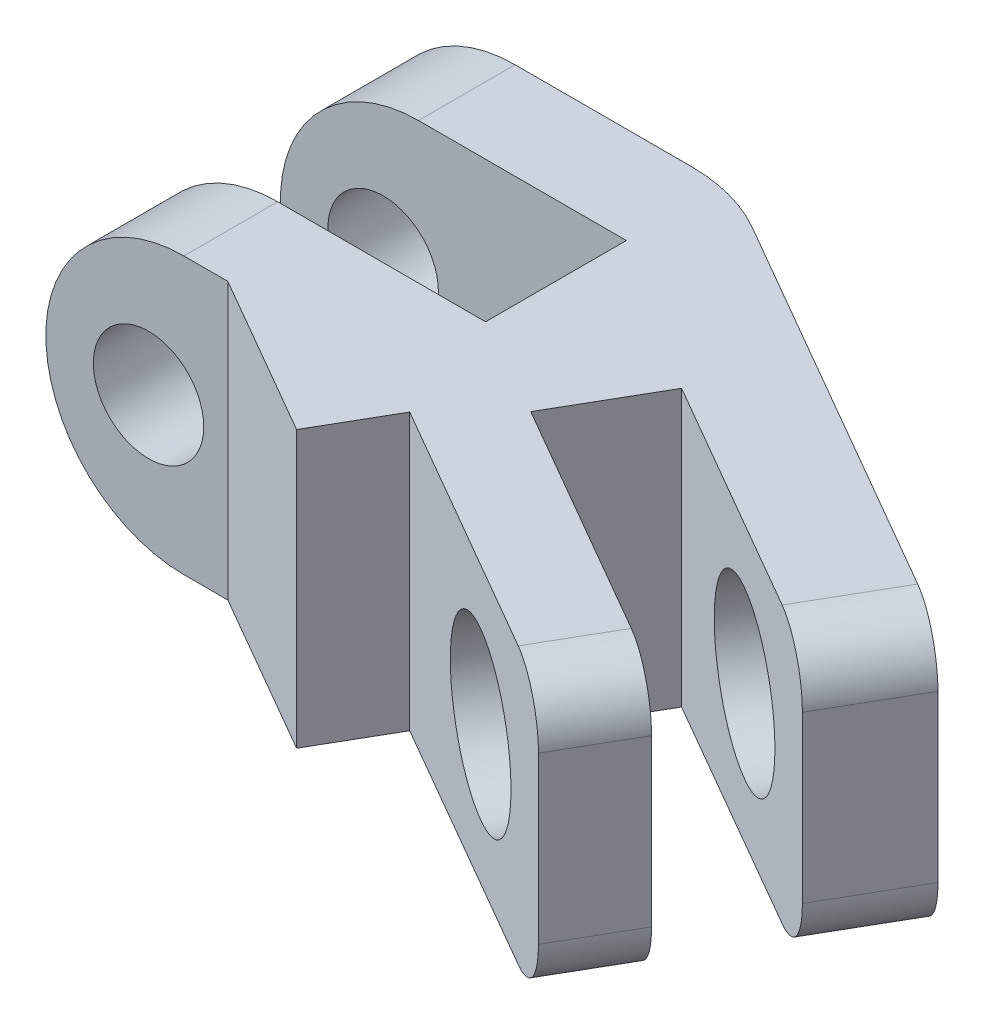
ISO-10303-21;
HEADER;
FILE_DESCRIPTION(('STEP AP214'),'2;1');
FILE_NAME('part.step','',(''),(''),'','','');
FILE_SCHEMA(('AUTOMOTIVE_DESIGN { 1 0 10303 214 1 1 1 1 }'));
ENDSEC;
DATA;
#1=APPLICATION_CONTEXT('core data for automotive mechanical design processes');
#2=APPLICATION_PROTOCOL_DEFINITION('international standard','automotive_design',2000,#1);
#3=PRODUCT_CONTEXT('',#1,'mechanical');
#4=PRODUCT('Part','Part','',(#3));
#5=PRODUCT_RELATED_PRODUCT_CATEGORY('part','',(#4));
#6=PRODUCT_DEFINITION_FORMATION('','',#4);
#7=PRODUCT_DEFINITION_CONTEXT('part definition',#1,'design');
#8=PRODUCT_DEFINITION('design','',#6,#7);
#9=PRODUCT_DEFINITION_SHAPE('','',#8);
#10=(LENGTH_UNIT() NAMED_UNIT(*) SI_UNIT(.MILLI.,.METRE.));
#11=(NAMED_UNIT(*) PLANE_ANGLE_UNIT() SI_UNIT($,.RADIAN.));
#12=(NAMED_UNIT(*) SI_UNIT($,.STERADIAN.) SOLID_ANGLE_UNIT());
#13=UNCERTAINTY_MEASURE_WITH_UNIT(LENGTH_MEASURE(1.E-05),#10,'distance_accuracy_value','');
#14=(GEOMETRIC_REPRESENTATION_CONTEXT(3) GLOBAL_UNCERTAINTY_ASSIGNED_CONTEXT((#13)) GLOBAL_UNIT_ASSIGNED_CONTEXT((#10,
#11,#12)) REPRESENTATION_CONTEXT('',''));
#15=CARTESIAN_POINT('',(0.,0.,0.));
#16=DIRECTION('',(0.,0.,1.));
#17=DIRECTION('',(1.,0.,0.));
#18=AXIS2_PLACEMENT_3D('',#15,#16,#17);
#19=CARTESIAN_POINT('',(0.,0.,6.));
#20=DIRECTION('',(0.,0.,-1.));
#21=DIRECTION('',(-1.,0.,0.));
#22=AXIS2_PLACEMENT_3D('',#19,#20,#21);
#23=CYLINDRICAL_SURFACE('',#22,2.5);
#24=CARTESIAN_POINT('',(0.,0.,1.75));
#25=DIRECTION('',(0.,0.,1.));
#26=DIRECTION('',(1.,0.,0.));
#27=AXIS2_PLACEMENT_3D('',#24,#25,#26);
#28=CIRCLE('',#27,2.5);
#29=CARTESIAN_POINT('',(0.,2.5,1.75));
#30=VERTEX_POINT('',#29);
#31=CARTESIAN_POINT('',(0.,-2.5,1.75));
#32=VERTEX_POINT('',#31);
#33=EDGE_CURVE('E218',#30,#32,#28,.T.);
#34=ORIENTED_EDGE('',*,*,#33,.F.);
#35=DIRECTION('',(0.,0.,-1.));
#36=VECTOR('',#35,1.);
#37=CARTESIAN_POINT('',(0.,2.5,12.4031242374328));
#38=LINE('',#37,#36);
#39=CARTESIAN_POINT('',(0.,2.5,0.));
#40=VERTEX_POINT('',#39);
#41=EDGE_CURVE('E304',#30,#40,#38,.T.);
#42=ORIENTED_EDGE('',*,*,#41,.T.);
#43=CARTESIAN_POINT('',(0.,0.,0.));
#44=DIRECTION('',(0.,0.,1.));
#45=DIRECTION('',(1.,0.,0.));
#46=AXIS2_PLACEMENT_3D('',#43,#44,#45);
#47=CIRCLE('',#46,2.5);
#48=CARTESIAN_POINT('',(0.,-2.5,0.));
#49=VERTEX_POINT('',#48);
#50=EDGE_CURVE('E308',#40,#49,#47,.T.);
#51=ORIENTED_EDGE('',*,*,#50,.T.);
#52=DIRECTION('',(0.,0.,-1.));
#53=VECTOR('',#52,1.);
#54=CARTESIAN_POINT('',(0.,-2.5,12.4031242374328));
#55=LINE('',#54,#53);
#56=EDGE_CURVE('E300',#32,#49,#55,.T.);
#57=ORIENTED_EDGE('',*,*,#56,.F.);
#58=EDGE_LOOP('',(#34,#42,#51,#57));
#59=FACE_BOUND('',#58,.T.);
#60=ADVANCED_FACE('F35',(#59),#23,.T.);
#61=CARTESIAN_POINT('',(-0.639695783803518,0.,0.));
#62=DIRECTION('',(0.,0.,1.));
#63=DIRECTION('',(1.,0.,0.));
#64=AXIS2_PLACEMENT_3D('',#61,#62,#63);
#65=CYLINDRICAL_SURFACE('',#64,1.);
#66=CARTESIAN_POINT('',(-0.639695783803518,0.,0.));
#67=DIRECTION('',(0.,0.,1.));
#68=DIRECTION('',(1.,0.,0.));
#69=AXIS2_PLACEMENT_3D('',#66,#67,#68);
#70=CIRCLE('',#69,1.);
#71=CARTESIAN_POINT('',(0.360304216196482,0.,0.));
#72=VERTEX_POINT('',#71);
#73=EDGE_CURVE('E245',#72,#72,#70,.T.);
#74=CARTESIAN_POINT('',(-0.639695783803518,0.,1.75));
#75=DIRECTION('',(0.,0.,1.));
#76=DIRECTION('',(1.,0.,0.));
#77=AXIS2_PLACEMENT_3D('',#74,#75,#76);
#78=CIRCLE('',#77,1.);
#79=CARTESIAN_POINT('',(0.360304216196482,0.,1.75));
#80=VERTEX_POINT('',#79);
#81=EDGE_CURVE('E244',#80,#80,#78,.F.);
#82=CARTESIAN_POINT('',(0.360304216196482,0.,0.));
#83=CARTESIAN_POINT('',(0.360304216196482,0.,0.0182291666666658));
#84=CARTESIAN_POINT('',(0.360304216196482,0.,0.0364583333333325));
#85=CARTESIAN_POINT('',(0.360304216196482,0.,0.0729166666666658));
#86=CARTESIAN_POINT('',(0.360304216196482,0.,0.0911458333333325));
#87=CARTESIAN_POINT('',(0.360304216196482,0.,0.127604166666666));
#88=CARTESIAN_POINT('',(0.360304216196482,0.,0.145833333333333));
#89=CARTESIAN_POINT('',(0.360304216196482,0.,0.182291666666666));
#90=CARTESIAN_POINT('',(0.360304216196482,0.,0.200520833333333));
#91=CARTESIAN_POINT('',(0.360304216196482,0.,0.236979166666666));
#92=CARTESIAN_POINT('',(0.360304216196482,0.,0.255208333333333));
#93=CARTESIAN_POINT('',(0.360304216196482,0.,0.291666666666666));
#94=CARTESIAN_POINT('',(0.360304216196482,0.,0.309895833333333));
#95=CARTESIAN_POINT('',(0.360304216196482,0.,0.346354166666666));
#96=CARTESIAN_POINT('',(0.360304216196482,0.,0.364583333333333));
#97=CARTESIAN_POINT('',(0.360304216196482,0.,0.401041666666666));
#98=CARTESIAN_POINT('',(0.360304216196482,0.,0.419270833333333));
#99=CARTESIAN_POINT('',(0.360304216196482,0.,0.455729166666666));
#100=CARTESIAN_POINT('',(0.360304216196482,0.,0.473958333333333));
#101=CARTESIAN_POINT('',(0.360304216196482,0.,0.510416666666666));
#102=CARTESIAN_POINT('',(0.360304216196482,0.,0.528645833333333));
#103=CARTESIAN_POINT('',(0.360304216196482,0.,0.565104166666666));
#104=CARTESIAN_POINT('',(0.360304216196482,0.,0.583333333333333));
#105=CARTESIAN_POINT('',(0.360304216196482,0.,0.619791666666666));
#106=CARTESIAN_POINT('',(0.360304216196482,0.,0.638020833333333));
#107=CARTESIAN_POINT('',(0.360304216196482,0.,0.674479166666666));
#108=CARTESIAN_POINT('',(0.360304216196482,0.,0.692708333333333));
#109=CARTESIAN_POINT('',(0.360304216196482,0.,0.729166666666666));
#110=CARTESIAN_POINT('',(0.360304216196482,0.,0.747395833333333));
#111=CARTESIAN_POINT('',(0.360304216196482,0.,0.783854166666666));
#112=CARTESIAN_POINT('',(0.360304216196482,0.,0.802083333333333));
#113=CARTESIAN_POINT('',(0.360304216196482,0.,0.838541666666666));
#114=CARTESIAN_POINT('',(0.360304216196482,0.,0.856770833333333));
#115=CARTESIAN_POINT('',(0.360304216196482,0.,0.893229166666666));
#116=CARTESIAN_POINT('',(0.360304216196482,0.,0.911458333333333));
#117=CARTESIAN_POINT('',(0.360304216196482,0.,0.947916666666666));
#118=CARTESIAN_POINT('',(0.360304216196482,0.,0.966145833333333));
#119=CARTESIAN_POINT('',(0.360304216196482,0.,1.00260416666667));
#120=CARTESIAN_POINT('',(0.360304216196482,0.,1.02083333333333));
#121=CARTESIAN_POINT('',(0.360304216196482,0.,1.05729166666667));
#122=CARTESIAN_POINT('',(0.360304216196482,0.,1.07552083333333));
#123=CARTESIAN_POINT('',(0.360304216196482,0.,1.11197916666667));
#124=CARTESIAN_POINT('',(0.360304216196482,0.,1.13020833333333));
#125=CARTESIAN_POINT('',(0.360304216196482,0.,1.16666666666667));
#126=CARTESIAN_POINT('',(0.360304216196482,0.,1.18489583333333));
#127=CARTESIAN_POINT('',(0.360304216196482,0.,1.22135416666667));
#128=CARTESIAN_POINT('',(0.360304216196482,0.,1.23958333333333));
#129=CARTESIAN_POINT('',(0.360304216196482,0.,1.27604166666667));
#130=CARTESIAN_POINT('',(0.360304216196482,0.,1.29427083333333));
#131=CARTESIAN_POINT('',(0.360304216196482,0.,1.33072916666667));
#132=CARTESIAN_POINT('',(0.360304216196482,0.,1.34895833333333));
#133=CARTESIAN_POINT('',(0.360304216196482,0.,1.38541666666667));
#134=CARTESIAN_POINT('',(0.360304216196482,0.,1.40364583333333));
#135=CARTESIAN_POINT('',(0.360304216196482,0.,1.44010416666667));
#136=CARTESIAN_POINT('',(0.360304216196482,0.,1.45833333333333));
#137=CARTESIAN_POINT('',(0.360304216196482,0.,1.49479166666667));
#138=CARTESIAN_POINT('',(0.360304216196482,0.,1.51302083333333));
#139=CARTESIAN_POINT('',(0.360304216196482,0.,1.54947916666667));
#140=CARTESIAN_POINT('',(0.360304216196482,0.,1.56770833333333));
#141=CARTESIAN_POINT('',(0.360304216196482,0.,1.60416666666667));
#142=CARTESIAN_POINT('',(0.360304216196482,0.,1.62239583333333));
#143=CARTESIAN_POINT('',(0.360304216196482,0.,1.65885416666667));
#144=CARTESIAN_POINT('',(0.360304216196482,0.,1.67708333333333));
#145=CARTESIAN_POINT('',(0.360304216196482,0.,1.71354166666667));
#146=CARTESIAN_POINT('',(0.360304216196482,0.,1.73177083333333));
#147=CARTESIAN_POINT('',(0.360304216196482,0.,1.75));
#148=B_SPLINE_CURVE_WITH_KNOTS('',3,(#82,#83,#84,#85,#86,#87,#88,#89,#90,#91,#92,#93,#94,#95,
#96,#97,#98,#99,#100,#101,#102,#103,#104,#105,#106,#107,#108,#109,#110,#111,#112,#113,#114,#115,
#116,#117,#118,#119,#120,#121,#122,#123,#124,#125,#126,#127,#128,#129,#130,#131,#132,#133,#134,
#135,#136,#137,#138,#139,#140,#141,#142,#143,#144,#145,#146,#147),.UNSPECIFIED.,.F.,.F.,(4,2,2,
2,2,2,2,2,2,2,2,2,2,2,2,2,2,2,2,2,2,2,2,2,2,2,2,2,2,2,2,2,4),(0.,0.0546875,0.109375,0.1640625,
0.21875,0.2734375,0.328125,0.3828125,0.4375,0.4921875,0.546875,0.6015625,0.65625,0.7109375,
0.765625,0.8203125,0.875,0.929687500000001,0.984375,1.0390625,1.09375,1.1484375,1.203125,
1.2578125,1.3125,1.3671875,1.421875,1.4765625,1.53125,1.5859375,1.640625,1.6953125,1.75),.UNSPECIFIED.);
#149=EDGE_CURVE('BSEAM453',#72,#80,#148,.T.);
#150=ORIENTED_EDGE('',*,*,#73,.F.);
#151=ORIENTED_EDGE('',*,*,#81,.F.);
#152=ORIENTED_EDGE('',*,*,#149,.T.);
#153=ORIENTED_EDGE('',*,*,#149,.F.);
#154=EDGE_LOOP('',(#150,#152,#151,#153));
#155=FACE_BOUND('',#154,.T.);
#156=ADVANCED_FACE('F453',(#155),#65,.F.);
#157=CARTESIAN_POINT('',(9.26121593216772,-2.5,10.8873066958947));
#158=DIRECTION('',(-0.866025403784438,0.,-0.500000000000001));
#159=DIRECTION('',(-0.500000000000001,0.,0.866025403784438));
#160=AXIS2_PLACEMENT_3D('',#157,#158,#159);
#161=PLANE('',#160);
#162=DIRECTION('',(0.,1.,0.));
#163=VECTOR('',#162,1.);
#164=CARTESIAN_POINT('',(12.6602540378444,-2.5,5.00000000000001));
#165=LINE('',#164,#163);
#166=CARTESIAN_POINT('',(12.6602540378444,-1.5,5.00000000000001));
#167=VERTEX_POINT('',#166);
#168=CARTESIAN_POINT('',(12.6602540378444,1.5,5.00000000000001));
#169=VERTEX_POINT('',#168);
#170=EDGE_CURVE('E283',#167,#169,#165,.T.);
#171=ORIENTED_EDGE('',*,*,#170,.T.);
#172=DIRECTION('',(0.500000000000001,0.,-0.866025403784438));
#173=VECTOR('',#172,1.);
#174=CARTESIAN_POINT('',(11.7612159321677,1.5,6.55717967697246));
#175=LINE('',#174,#173);
#176=CARTESIAN_POINT('',(11.7612159321677,1.5,6.55717967697246));
#177=VERTEX_POINT('',#176);
#178=EDGE_CURVE('E57',#169,#177,#175,.F.);
#179=ORIENTED_EDGE('',*,*,#178,.T.);
#180=DIRECTION('',(0.,1.,0.));
#181=VECTOR('',#180,1.);
#182=CARTESIAN_POINT('',(11.7612159321677,-2.5,6.55717967697246));
#183=LINE('',#182,#181);
#184=CARTESIAN_POINT('',(11.7612159321677,-1.5,6.55717967697246));
#185=VERTEX_POINT('',#184);
#186=EDGE_CURVE('E258',#185,#177,#183,.T.);
#187=ORIENTED_EDGE('',*,*,#186,.F.);
#188=DIRECTION('',(0.500000000000001,0.,-0.866025403784438));
#189=VECTOR('',#188,1.);
#190=CARTESIAN_POINT('',(12.6602540378444,-1.5,5.00000000000001));
#191=LINE('',#190,#189);
#192=EDGE_CURVE('E353',#185,#167,#191,.T.);
#193=ORIENTED_EDGE('',*,*,#192,.T.);
#194=EDGE_LOOP('',(#171,#179,#187,#193));
#195=FACE_BOUND('',#194,.T.);
#196=ADVANCED_FACE('F371',(#195),#161,.F.);
#197=CARTESIAN_POINT('',(0.,2.5,6.));
#198=VERTEX_POINT('',#197);
#199=CARTESIAN_POINT('',(0.,2.5,4.3));
#200=VERTEX_POINT('',#199);
#201=EDGE_CURVE('E305',#198,#200,#38,.T.);
#202=ORIENTED_EDGE('',*,*,#201,.T.);
#203=CARTESIAN_POINT('',(0.,0.,4.3));
#204=DIRECTION('',(0.,0.,1.));
#205=DIRECTION('',(1.,0.,0.));
#206=AXIS2_PLACEMENT_3D('',#203,#204,#205);
#207=CIRCLE('',#206,2.5);
#208=CARTESIAN_POINT('',(0.,-2.5,4.3));
#209=VERTEX_POINT('',#208);
#210=EDGE_CURVE('E228',#200,#209,#207,.T.);
#211=ORIENTED_EDGE('',*,*,#210,.T.);
#212=CARTESIAN_POINT('',(0.,-2.5,6.));
#213=VERTEX_POINT('',#212);
#214=EDGE_CURVE('E301',#213,#209,#55,.T.);
#215=ORIENTED_EDGE('',*,*,#214,.F.);
#216=CARTESIAN_POINT('',(0.,0.,6.));
#217=DIRECTION('',(0.,0.,1.));
#218=DIRECTION('',(1.,0.,0.));
#219=AXIS2_PLACEMENT_3D('',#216,#217,#218);
#220=CIRCLE('',#219,2.5);
#221=EDGE_CURVE('E309',#198,#213,#220,.T.);
#222=ORIENTED_EDGE('',*,*,#221,.F.);
#223=EDGE_LOOP('',(#202,#211,#215,#222));
#224=FACE_BOUND('',#223,.T.);
#225=ADVANCED_FACE('F411',(#224),#23,.T.);
#226=CARTESIAN_POINT('',(0.,0.,6.));
#227=DIRECTION('',(0.,0.,1.));
#228=DIRECTION('',(1.,0.,0.));
#229=AXIS2_PLACEMENT_3D('',#226,#227,#228);
#230=PLANE('',#229);
#231=CARTESIAN_POINT('',(-0.639695783803518,0.,6.));
#232=DIRECTION('',(0.,0.,1.));
#233=DIRECTION('',(1.,0.,0.));
#234=AXIS2_PLACEMENT_3D('',#231,#232,#233);
#235=CIRCLE('',#234,1.);
#236=CARTESIAN_POINT('',(0.360304216196482,0.,6.));
#237=VERTEX_POINT('',#236);
#238=EDGE_CURVE('E249',#237,#237,#235,.T.);
#239=ORIENTED_EDGE('',*,*,#238,.F.);
#240=EDGE_LOOP('',(#239));
#241=FACE_BOUND('',#240,.T.);
#242=DIRECTION('',(0.,-1.,0.));
#243=VECTOR('',#242,1.);
#244=CARTESIAN_POINT('',(0.796152422706628,0.,6.));
#245=LINE('',#244,#243);
#246=CARTESIAN_POINT('',(0.796152422706628,2.5,6.));
#247=VERTEX_POINT('',#246);
#248=CARTESIAN_POINT('',(0.79615242270663,-2.5,6.));
#249=VERTEX_POINT('',#248);
#250=EDGE_CURVE('E289',#247,#249,#245,.T.);
#251=ORIENTED_EDGE('',*,*,#250,.F.);
#252=DIRECTION('',(1.,0.,0.));
#253=VECTOR('',#252,1.);
#254=CARTESIAN_POINT('',(0.,2.5,6.));
#255=LINE('',#254,#253);
#256=EDGE_CURVE('E294',#198,#247,#255,.T.);
#257=ORIENTED_EDGE('',*,*,#256,.F.);
#258=ORIENTED_EDGE('',*,*,#221,.T.);
#259=DIRECTION('',(-1.,0.,0.));
#260=VECTOR('',#259,1.);
#261=CARTESIAN_POINT('',(0.,-2.5,6.));
#262=LINE('',#261,#260);
#263=EDGE_CURVE('E298',#249,#213,#262,.T.);
#264=ORIENTED_EDGE('',*,*,#263,.F.);
#265=EDGE_LOOP('',(#251,#257,#258,#264));
#266=FACE_BOUND('',#265,.T.);
#267=ADVANCED_FACE('F416',(#241,#266),#230,.T.);
#268=CARTESIAN_POINT('',(0.,0.,0.));
#269=DIRECTION('',(0.,0.,1.));
#270=DIRECTION('',(1.,0.,0.));
#271=AXIS2_PLACEMENT_3D('',#268,#269,#270);
#272=PLANE('',#271);
#273=ORIENTED_EDGE('',*,*,#73,.T.);
#274=EDGE_LOOP('',(#273));
#275=FACE_BOUND('',#274,.T.);
#276=DIRECTION('',(1.,0.,0.));
#277=VECTOR('',#276,1.);
#278=CARTESIAN_POINT('',(0.,2.5,0.));
#279=LINE('',#278,#277);
#280=CARTESIAN_POINT('',(3.19615242270663,2.5,0.));
#281=VERTEX_POINT('',#280);
#282=EDGE_CURVE('E291',#40,#281,#279,.T.);
#283=ORIENTED_EDGE('',*,*,#282,.T.);
#284=DIRECTION('',(0.,-1.,0.));
#285=VECTOR('',#284,1.);
#286=CARTESIAN_POINT('',(3.19615242270663,0.,0.));
#287=LINE('',#286,#285);
#288=CARTESIAN_POINT('',(3.19615242270663,-2.5,0.));
#289=VERTEX_POINT('',#288);
#290=EDGE_CURVE('E312',#281,#289,#287,.T.);
#291=ORIENTED_EDGE('',*,*,#290,.T.);
#292=DIRECTION('',(-1.,0.,0.));
#293=VECTOR('',#292,1.);
#294=CARTESIAN_POINT('',(0.,-2.5,0.));
#295=LINE('',#294,#293);
#296=EDGE_CURVE('E292',#289,#49,#295,.T.);
#297=ORIENTED_EDGE('',*,*,#296,.T.);
#298=ORIENTED_EDGE('',*,*,#50,.F.);
#299=EDGE_LOOP('',(#283,#291,#297,#298));
#300=FACE_BOUND('',#299,.T.);
#301=ADVANCED_FACE('F388',(#275,#300),#272,.F.);
#302=CARTESIAN_POINT('',(0.,2.5,12.4031242374328));
#303=DIRECTION('',(0.,1.,0.));
#304=DIRECTION('',(-1.,0.,0.));
#305=AXIS2_PLACEMENT_3D('',#302,#303,#304);
#306=PLANE('',#305);
#307=DIRECTION('',(-0.500000000000001,0.,0.866025403784438));
#308=VECTOR('',#307,1.);
#309=CARTESIAN_POINT('',(4.49439855055948,2.5,6.40313258987647));
#310=LINE('',#309,#308);
#311=CARTESIAN_POINT('',(4.49439855055948,2.5,6.40313258987647));
#312=VERTEX_POINT('',#311);
#313=CARTESIAN_POINT('',(3.74439855055948,2.5,7.70217069555312));
#314=VERTEX_POINT('',#313);
#315=EDGE_CURVE('E190',#312,#314,#310,.T.);
#316=ORIENTED_EDGE('',*,*,#315,.F.);
#317=DIRECTION('',(-0.866025403784438,0.,-0.500000000000001));
#318=VECTOR('',#317,1.);
#319=CARTESIAN_POINT('',(10.0112159321677,2.5,9.588268590218));
#320=LINE('',#319,#318);
#321=CARTESIAN_POINT('',(9.14519052838328,2.5,9.088268590218));
#322=VERTEX_POINT('',#321);
#323=EDGE_CURVE('E178',#322,#312,#320,.T.);
#324=ORIENTED_EDGE('',*,*,#323,.F.);
#325=DIRECTION('',(0.500000000000001,0.,-0.866025403784438));
#326=VECTOR('',#325,1.);
#327=CARTESIAN_POINT('',(9.89519052838328,2.5,7.78923048454134));
#328=LINE('',#327,#326);
#329=CARTESIAN_POINT('',(9.89519052838328,2.5,7.78923048454133));
#330=VERTEX_POINT('',#329);
#331=EDGE_CURVE('E347',#322,#330,#328,.T.);
#332=ORIENTED_EDGE('',*,*,#331,.T.);
#333=DIRECTION('',(-0.866025403784438,0.,-0.500000000000001));
#334=VECTOR('',#333,1.);
#335=CARTESIAN_POINT('',(10.7612159321677,2.5,8.28923048454133));
#336=LINE('',#335,#334);
#337=CARTESIAN_POINT('',(5.58442333430455,2.5,5.30040788462617));
#338=VERTEX_POINT('',#337);
#339=EDGE_CURVE('E271',#330,#338,#336,.T.);
#340=ORIENTED_EDGE('',*,*,#339,.T.);
#341=DIRECTION('',(0.500000000000001,0.,-0.866025403784438));
#342=VECTOR('',#341,1.);
#343=CARTESIAN_POINT('',(5.58442333430455,2.5,5.30040788462617));
#344=LINE('',#343,#342);
#345=CARTESIAN_POINT('',(6.58442333430456,2.5,3.56835707705729));
#346=VERTEX_POINT('',#345);
#347=EDGE_CURVE('E273',#338,#346,#344,.T.);
#348=ORIENTED_EDGE('',*,*,#347,.T.);
#349=DIRECTION('',(-0.866025403784438,0.,-0.500000000000001));
#350=VECTOR('',#349,1.);
#351=CARTESIAN_POINT('',(11.7612159321677,2.5,6.55717967697246));
#352=LINE('',#351,#350);
#353=CARTESIAN_POINT('',(10.8951905283833,2.5,6.05717967697246));
#354=VERTEX_POINT('',#353);
#355=EDGE_CURVE('E260',#354,#346,#352,.T.);
#356=ORIENTED_EDGE('',*,*,#355,.F.);
#357=DIRECTION('',(0.500000000000001,0.,-0.866025403784438));
#358=VECTOR('',#357,1.);
#359=CARTESIAN_POINT('',(11.7942286340599,2.5,4.50000000000001));
#360=LINE('',#359,#358);
#361=CARTESIAN_POINT('',(11.7942286340599,2.5,4.50000000000001));
#362=VERTEX_POINT('',#361);
#363=EDGE_CURVE('E344',#354,#362,#360,.T.);
#364=ORIENTED_EDGE('',*,*,#363,.T.);
#365=DIRECTION('',(-0.866025403784438,0.,-0.500000000000001));
#366=VECTOR('',#365,1.);
#367=CARTESIAN_POINT('',(12.6602540378444,2.5,5.00000000000001));
#368=LINE('',#367,#366);
#369=CARTESIAN_POINT('',(4.69615242270663,2.5,0.401923788646685));
#370=VERTEX_POINT('',#369);
#371=EDGE_CURVE('E278',#362,#370,#368,.T.);
#372=ORIENTED_EDGE('',*,*,#371,.T.);
#373=CARTESIAN_POINT('',(3.19615242270663,2.5,3.));
#374=DIRECTION('',(0.,1.,0.));
#375=DIRECTION('',(-1.,0.,0.));
#376=AXIS2_PLACEMENT_3D('',#373,#374,#375);
#377=CIRCLE('',#376,3.);
#378=EDGE_CURVE('E326',#370,#281,#377,.T.);
#379=ORIENTED_EDGE('',*,*,#378,.T.);
#380=ORIENTED_EDGE('',*,*,#282,.F.);
#381=ORIENTED_EDGE('',*,*,#41,.F.);
#382=DIRECTION('',(-1.,0.,0.));
#383=VECTOR('',#382,1.);
#384=CARTESIAN_POINT('',(3.76569860759446,2.5,1.75));
#385=LINE('',#384,#383);
#386=CARTESIAN_POINT('',(3.76569860759446,2.5,1.75));
#387=VERTEX_POINT('',#386);
#388=EDGE_CURVE('E226',#387,#30,#385,.T.);
#389=ORIENTED_EDGE('',*,*,#388,.F.);
#390=DIRECTION('',(0.,0.,-1.));
#391=VECTOR('',#390,1.);
#392=CARTESIAN_POINT('',(3.76569860759446,2.5,4.3));
#393=LINE('',#392,#391);
#394=CARTESIAN_POINT('',(3.76569860759446,2.5,4.3));
#395=VERTEX_POINT('',#394);
#396=EDGE_CURVE('E239',#395,#387,#393,.T.);
#397=ORIENTED_EDGE('',*,*,#396,.F.);
#398=DIRECTION('',(-1.,0.,0.));
#399=VECTOR('',#398,1.);
#400=CARTESIAN_POINT('',(3.76569860759446,2.5,4.3));
#401=LINE('',#400,#399);
#402=EDGE_CURVE('E236',#395,#200,#401,.T.);
#403=ORIENTED_EDGE('',*,*,#402,.T.);
#404=ORIENTED_EDGE('',*,*,#201,.F.);
#405=ORIENTED_EDGE('',*,*,#256,.T.);
#406=DIRECTION('',(-0.866025403784438,0.,-0.500000000000001));
#407=VECTOR('',#406,1.);
#408=CARTESIAN_POINT('',(9.26121593216772,2.5,10.8873066958947));
#409=LINE('',#408,#407);
#410=EDGE_CURVE('E198',#314,#247,#409,.T.);
#411=ORIENTED_EDGE('',*,*,#410,.F.);
#412=EDGE_LOOP('',(#316,#324,#332,#340,#348,#356,#364,#372,#379,#380,#381,#389,#397,#403,#404,
#405,#411));
#413=FACE_BOUND('',#412,.T.);
#414=ADVANCED_FACE('F196',(#413),#306,.T.);
#415=CARTESIAN_POINT('',(0.,-2.5,12.4031242374328));
#416=DIRECTION('',(0.,-1.,0.));
#417=DIRECTION('',(1.,0.,0.));
#418=AXIS2_PLACEMENT_3D('',#415,#416,#417);
#419=PLANE('',#418);
#420=DIRECTION('',(0.500000000000001,0.,-0.866025403784438));
#421=VECTOR('',#420,1.);
#422=CARTESIAN_POINT('',(0.772726318280463,-2.5,12.849257985302));
#423=LINE('',#422,#421);
#424=CARTESIAN_POINT('',(3.74439855055948,-2.5,7.70217069555312));
#425=VERTEX_POINT('',#424);
#426=CARTESIAN_POINT('',(4.49439855055948,-2.5,6.40313258987647));
#427=VERTEX_POINT('',#426);
#428=EDGE_CURVE('E193',#425,#427,#423,.T.);
#429=ORIENTED_EDGE('',*,*,#428,.F.);
#430=DIRECTION('',(0.866025403784438,0.,0.500000000000001));
#431=VECTOR('',#430,1.);
#432=CARTESIAN_POINT('',(0.600961894323334,-2.5,5.88730669589464));
#433=LINE('',#432,#431);
#434=EDGE_CURVE('E286',#249,#425,#433,.T.);
#435=ORIENTED_EDGE('',*,*,#434,.F.);
#436=ORIENTED_EDGE('',*,*,#263,.T.);
#437=ORIENTED_EDGE('',*,*,#214,.T.);
#438=DIRECTION('',(1.,0.,0.));
#439=VECTOR('',#438,1.);
#440=CARTESIAN_POINT('',(0.,-2.5,4.3));
#441=LINE('',#440,#439);
#442=CARTESIAN_POINT('',(3.76569860759446,-2.5,4.3));
#443=VERTEX_POINT('',#442);
#444=EDGE_CURVE('E231',#209,#443,#441,.T.);
#445=ORIENTED_EDGE('',*,*,#444,.T.);
#446=DIRECTION('',(0.,0.,-1.));
#447=VECTOR('',#446,1.);
#448=CARTESIAN_POINT('',(3.76569860759446,-2.5,4.3));
#449=LINE('',#448,#447);
#450=CARTESIAN_POINT('',(3.76569860759446,-2.5,1.75));
#451=VERTEX_POINT('',#450);
#452=EDGE_CURVE('E241',#443,#451,#449,.T.);
#453=ORIENTED_EDGE('',*,*,#452,.T.);
#454=DIRECTION('',(1.,0.,0.));
#455=VECTOR('',#454,1.);
#456=CARTESIAN_POINT('',(0.,-2.5,1.75));
#457=LINE('',#456,#455);
#458=EDGE_CURVE('E220',#32,#451,#457,.T.);
#459=ORIENTED_EDGE('',*,*,#458,.F.);
#460=ORIENTED_EDGE('',*,*,#56,.T.);
#461=ORIENTED_EDGE('',*,*,#296,.F.);
#462=CARTESIAN_POINT('',(3.19615242270663,-2.5,3.));
#463=DIRECTION('',(0.,-1.,0.));
#464=DIRECTION('',(1.,0.,0.));
#465=AXIS2_PLACEMENT_3D('',#462,#463,#464);
#466=CIRCLE('',#465,3.);
#467=CARTESIAN_POINT('',(4.69615242270663,-2.5,0.401923788646685));
#468=VERTEX_POINT('',#467);
#469=EDGE_CURVE('E321',#289,#468,#466,.T.);
#470=ORIENTED_EDGE('',*,*,#469,.T.);
#471=DIRECTION('',(0.866025403784438,0.,0.500000000000001));
#472=VECTOR('',#471,1.);
#473=CARTESIAN_POINT('',(4.,-2.5,0.));
#474=LINE('',#473,#472);
#475=CARTESIAN_POINT('',(11.7942286340599,-2.5,4.50000000000001));
#476=VERTEX_POINT('',#475);
#477=EDGE_CURVE('E280',#468,#476,#474,.T.);
#478=ORIENTED_EDGE('',*,*,#477,.T.);
#479=DIRECTION('',(0.500000000000001,0.,-0.866025403784438));
#480=VECTOR('',#479,1.);
#481=CARTESIAN_POINT('',(10.8951905283833,-2.5,6.05717967697246));
#482=LINE('',#481,#480);
#483=CARTESIAN_POINT('',(10.8951905283833,-2.5,6.05717967697246));
#484=VERTEX_POINT('',#483);
#485=EDGE_CURVE('E339',#476,#484,#482,.F.);
#486=ORIENTED_EDGE('',*,*,#485,.T.);
#487=DIRECTION('',(0.866025403784438,0.,0.500000000000001));
#488=VECTOR('',#487,1.);
#489=CARTESIAN_POINT('',(6.58442333430456,-2.5,3.56835707705729));
#490=LINE('',#489,#488);
#491=CARTESIAN_POINT('',(6.58442333430456,-2.5,3.56835707705729));
#492=VERTEX_POINT('',#491);
#493=EDGE_CURVE('E255',#492,#484,#490,.T.);
#494=ORIENTED_EDGE('',*,*,#493,.F.);
#495=DIRECTION('',(0.500000000000001,0.,-0.866025403784438));
#496=VECTOR('',#495,1.);
#497=CARTESIAN_POINT('',(5.58442333430455,-2.5,5.30040788462617));
#498=LINE('',#497,#496);
#499=CARTESIAN_POINT('',(5.58442333430455,-2.5,5.30040788462617));
#500=VERTEX_POINT('',#499);
#501=EDGE_CURVE('E276',#500,#492,#498,.T.);
#502=ORIENTED_EDGE('',*,*,#501,.F.);
#503=DIRECTION('',(0.866025403784438,0.,0.500000000000001));
#504=VECTOR('',#503,1.);
#505=CARTESIAN_POINT('',(5.58442333430455,-2.5,5.30040788462617));
#506=LINE('',#505,#504);
#507=CARTESIAN_POINT('',(9.89519052838328,-2.5,7.78923048454134));
#508=VERTEX_POINT('',#507);
#509=EDGE_CURVE('E265',#500,#508,#506,.T.);
#510=ORIENTED_EDGE('',*,*,#509,.T.);
#511=DIRECTION('',(0.500000000000001,0.,-0.866025403784438));
#512=VECTOR('',#511,1.);
#513=CARTESIAN_POINT('',(8.39519052838328,-2.5,10.3873066958946));
#514=LINE('',#513,#512);
#515=CARTESIAN_POINT('',(9.14519052838328,-2.5,9.088268590218));
#516=VERTEX_POINT('',#515);
#517=EDGE_CURVE('E341',#508,#516,#514,.F.);
#518=ORIENTED_EDGE('',*,*,#517,.T.);
#519=DIRECTION('',(0.866025403784438,0.,0.500000000000001));
#520=VECTOR('',#519,1.);
#521=CARTESIAN_POINT('',(3.72167223227902,-2.5,5.95699884200733));
#522=LINE('',#521,#520);
#523=EDGE_CURVE('E201',#427,#516,#522,.T.);
#524=ORIENTED_EDGE('',*,*,#523,.F.);
#525=EDGE_LOOP('',(#429,#435,#436,#437,#445,#453,#459,#460,#461,#470,#478,#486,#494,#502,#510,
#518,#524));
#526=FACE_BOUND('',#525,.T.);
#527=ADVANCED_FACE('F379',(#526),#419,.T.);
#528=DIRECTION('',(0.500000000000001,0.,-0.866025403784438));
#529=VECTOR('',#528,1.);
#530=CARTESIAN_POINT('',(9.26121593216772,1.5,10.8873066958947));
#531=LINE('',#530,#529);
#532=CARTESIAN_POINT('',(10.7612159321677,1.5,8.28923048454133));
#533=VERTEX_POINT('',#532);
#534=CARTESIAN_POINT('',(10.0112159321677,1.5,9.588268590218));
#535=VERTEX_POINT('',#534);
#536=EDGE_CURVE('E328',#533,#535,#531,.F.);
#537=ORIENTED_EDGE('',*,*,#536,.T.);
#538=DIRECTION('',(0.,1.,0.));
#539=VECTOR('',#538,1.);
#540=CARTESIAN_POINT('',(10.0112159321677,2.5,9.588268590218));
#541=LINE('',#540,#539);
#542=CARTESIAN_POINT('',(10.0112159321677,-1.5,9.588268590218));
#543=VERTEX_POINT('',#542);
#544=EDGE_CURVE('E49',#543,#535,#541,.T.);
#545=ORIENTED_EDGE('',*,*,#544,.F.);
#546=DIRECTION('',(0.500000000000001,0.,-0.866025403784438));
#547=VECTOR('',#546,1.);
#548=CARTESIAN_POINT('',(10.7612159321677,-1.5,8.28923048454133));
#549=LINE('',#548,#547);
#550=CARTESIAN_POINT('',(10.7612159321677,-1.5,8.28923048454133));
#551=VERTEX_POINT('',#550);
#552=EDGE_CURVE('E333',#543,#551,#549,.T.);
#553=ORIENTED_EDGE('',*,*,#552,.T.);
#554=DIRECTION('',(0.,1.,0.));
#555=VECTOR('',#554,1.);
#556=CARTESIAN_POINT('',(10.7612159321677,-2.5,8.28923048454133));
#557=LINE('',#556,#555);
#558=EDGE_CURVE('E268',#551,#533,#557,.T.);
#559=ORIENTED_EDGE('',*,*,#558,.T.);
#560=EDGE_LOOP('',(#537,#545,#553,#559));
#561=FACE_BOUND('',#560,.T.);
#562=ADVANCED_FACE('F428',(#561),#161,.F.);
#563=CARTESIAN_POINT('',(-2.39903810567666,0.,4.15525588832576));
#564=DIRECTION('',(-0.500000000000001,0.,0.866025403784438));
#565=DIRECTION('',(0.866025403784438,0.,0.500000000000001));
#566=AXIS2_PLACEMENT_3D('',#563,#564,#565);
#567=PLANE('',#566);
#568=DIRECTION('',(0.,-1.,0.));
#569=VECTOR('',#568,1.);
#570=CARTESIAN_POINT('',(3.74439855055948,2.5,7.70217069555312));
#571=LINE('',#570,#569);
#572=EDGE_CURVE('E204',#314,#425,#571,.T.);
#573=ORIENTED_EDGE('',*,*,#572,.F.);
#574=ORIENTED_EDGE('',*,*,#410,.T.);
#575=ORIENTED_EDGE('',*,*,#250,.T.);
#576=ORIENTED_EDGE('',*,*,#434,.T.);
#577=EDGE_LOOP('',(#573,#574,#575,#576));
#578=FACE_BOUND('',#577,.T.);
#579=ADVANCED_FACE('F419',(#578),#567,.T.);
#580=CARTESIAN_POINT('',(1.,0.,-1.73205080756888));
#581=DIRECTION('',(-0.500000000000001,0.,0.866025403784438));
#582=DIRECTION('',(0.866025403784438,0.,0.500000000000001));
#583=AXIS2_PLACEMENT_3D('',#580,#581,#582);
#584=PLANE('',#583);
#585=CARTESIAN_POINT('',(10.1847912420043,0.,3.57079088845282));
#586=DIRECTION('',(-0.500000000000001,0.,0.866025403784438));
#587=DIRECTION('',(0.866025403784438,0.,0.500000000000001));
#588=AXIS2_PLACEMENT_3D('',#585,#586,#587);
#589=CIRCLE('',#588,1.5);
#590=CARTESIAN_POINT('',(11.4838293476809,0.,4.32079088845282));
#591=VERTEX_POINT('',#590);
#592=EDGE_CURVE('E215',#591,#591,#589,.T.);
#593=ORIENTED_EDGE('',*,*,#592,.T.);
#594=EDGE_LOOP('',(#593));
#595=FACE_BOUND('',#594,.T.);
#596=ORIENTED_EDGE('',*,*,#371,.F.);
#597=CARTESIAN_POINT('',(11.7942286340599,1.5,4.50000000000001));
#598=DIRECTION('',(-0.500000000000001,0.,0.866025403784438));
#599=DIRECTION('',(0.866025403784438,0.,0.500000000000001));
#600=AXIS2_PLACEMENT_3D('',#597,#598,#599);
#601=CIRCLE('',#600,1.);
#602=EDGE_CURVE('E351',#362,#169,#601,.F.);
#603=ORIENTED_EDGE('',*,*,#602,.T.);
#604=ORIENTED_EDGE('',*,*,#170,.F.);
#605=CARTESIAN_POINT('',(11.7942286340599,-1.5,4.50000000000001));
#606=DIRECTION('',(-0.500000000000001,0.,0.866025403784438));
#607=DIRECTION('',(0.866025403784438,0.,0.500000000000001));
#608=AXIS2_PLACEMENT_3D('',#605,#606,#607);
#609=CIRCLE('',#608,1.);
#610=EDGE_CURVE('E349',#167,#476,#609,.F.);
#611=ORIENTED_EDGE('',*,*,#610,.T.);
#612=ORIENTED_EDGE('',*,*,#477,.F.);
#613=DIRECTION('',(0.,-1.,0.));
#614=VECTOR('',#613,1.);
#615=CARTESIAN_POINT('',(4.69615242270663,0.,0.401923788646686));
#616=LINE('',#615,#614);
#617=EDGE_CURVE('E323',#468,#370,#616,.F.);
#618=ORIENTED_EDGE('',*,*,#617,.T.);
#619=EDGE_LOOP('',(#596,#603,#604,#611,#612,#618));
#620=FACE_BOUND('',#619,.T.);
#621=ADVANCED_FACE('F370',(#595,#620),#584,.F.);
#622=CARTESIAN_POINT('',(5.58442333430455,2.5,5.30040788462617));
#623=DIRECTION('',(0.866025403784438,0.,0.500000000000001));
#624=DIRECTION('',(0.500000000000001,0.,-0.866025403784438));
#625=AXIS2_PLACEMENT_3D('',#622,#623,#624);
#626=PLANE('',#625);
#627=ORIENTED_EDGE('',*,*,#347,.F.);
#628=DIRECTION('',(0.,-1.,0.));
#629=VECTOR('',#628,1.);
#630=CARTESIAN_POINT('',(5.58442333430455,2.5,5.30040788462617));
#631=LINE('',#630,#629);
#632=EDGE_CURVE('E262',#338,#500,#631,.T.);
#633=ORIENTED_EDGE('',*,*,#632,.T.);
#634=ORIENTED_EDGE('',*,*,#501,.T.);
#635=DIRECTION('',(0.,-1.,0.));
#636=VECTOR('',#635,1.);
#637=CARTESIAN_POINT('',(6.58442333430456,2.5,3.56835707705729));
#638=LINE('',#637,#636);
#639=EDGE_CURVE('E248',#346,#492,#638,.T.);
#640=ORIENTED_EDGE('',*,*,#639,.F.);
#641=EDGE_LOOP('',(#627,#633,#634,#640));
#642=FACE_BOUND('',#641,.T.);
#643=ADVANCED_FACE('F438',(#642),#626,.T.);
#644=CARTESIAN_POINT('',(-0.89903810567666,0.,1.55717967697245));
#645=DIRECTION('',(-0.500000000000001,0.,0.866025403784438));
#646=DIRECTION('',(0.866025403784438,0.,0.500000000000001));
#647=AXIS2_PLACEMENT_3D('',#644,#645,#646);
#648=PLANE('',#647);
#649=CARTESIAN_POINT('',(8.28575313632761,0.,6.86002137299414));
#650=DIRECTION('',(-0.500000000000001,0.,0.866025403784438));
#651=DIRECTION('',(0.866025403784438,0.,0.500000000000001));
#652=AXIS2_PLACEMENT_3D('',#649,#650,#651);
#653=CIRCLE('',#652,1.5);
#654=CARTESIAN_POINT('',(9.58479124200427,0.,7.61002137299414));
#655=VERTEX_POINT('',#654);
#656=EDGE_CURVE('E212',#655,#655,#653,.T.);
#657=ORIENTED_EDGE('',*,*,#656,.T.);
#658=EDGE_LOOP('',(#657));
#659=FACE_BOUND('',#658,.T.);
#660=ORIENTED_EDGE('',*,*,#558,.F.);
#661=CARTESIAN_POINT('',(9.89519052838328,-1.5,7.78923048454133));
#662=DIRECTION('',(-0.500000000000001,0.,0.866025403784438));
#663=DIRECTION('',(0.866025403784438,0.,0.500000000000001));
#664=AXIS2_PLACEMENT_3D('',#661,#662,#663);
#665=CIRCLE('',#664,1.);
#666=EDGE_CURVE('E337',#551,#508,#665,.F.);
#667=ORIENTED_EDGE('',*,*,#666,.T.);
#668=ORIENTED_EDGE('',*,*,#509,.F.);
#669=ORIENTED_EDGE('',*,*,#632,.F.);
#670=ORIENTED_EDGE('',*,*,#339,.F.);
#671=CARTESIAN_POINT('',(9.89519052838328,1.5,7.78923048454134));
#672=DIRECTION('',(-0.500000000000001,0.,0.866025403784438));
#673=DIRECTION('',(0.866025403784438,0.,0.500000000000001));
#674=AXIS2_PLACEMENT_3D('',#671,#672,#673);
#675=CIRCLE('',#674,1.);
#676=EDGE_CURVE('E335',#330,#533,#675,.F.);
#677=ORIENTED_EDGE('',*,*,#676,.T.);
#678=EDGE_LOOP('',(#660,#667,#668,#669,#670,#677));
#679=FACE_BOUND('',#678,.T.);
#680=ADVANCED_FACE('F440',(#659,#679),#648,.F.);
#681=CARTESIAN_POINT('',(0.100961894323342,0.,-0.174871130596428));
#682=DIRECTION('',(-0.500000000000001,0.,0.866025403784438));
#683=DIRECTION('',(0.866025403784438,0.,0.500000000000001));
#684=AXIS2_PLACEMENT_3D('',#681,#682,#683);
#685=PLANE('',#684);
#686=CARTESIAN_POINT('',(9.28575313632761,0.,5.12797056542527));
#687=DIRECTION('',(-0.500000000000001,0.,0.866025403784438));
#688=DIRECTION('',(0.866025403784438,0.,0.500000000000001));
#689=AXIS2_PLACEMENT_3D('',#686,#687,#688);
#690=CIRCLE('',#689,1.5);
#691=CARTESIAN_POINT('',(10.5847912420043,0.,5.87797056542527));
#692=VERTEX_POINT('',#691);
#693=EDGE_CURVE('E211',#692,#692,#690,.T.);
#694=ORIENTED_EDGE('',*,*,#693,.F.);
#695=EDGE_LOOP('',(#694));
#696=FACE_BOUND('',#695,.T.);
#697=ORIENTED_EDGE('',*,*,#186,.T.);
#698=CARTESIAN_POINT('',(10.8951905283833,1.5,6.05717967697246));
#699=DIRECTION('',(-0.500000000000001,0.,0.866025403784438));
#700=DIRECTION('',(0.866025403784438,0.,0.500000000000001));
#701=AXIS2_PLACEMENT_3D('',#698,#699,#700);
#702=CIRCLE('',#701,1.);
#703=EDGE_CURVE('E43',#177,#354,#702,.T.);
#704=ORIENTED_EDGE('',*,*,#703,.T.);
#705=ORIENTED_EDGE('',*,*,#355,.T.);
#706=ORIENTED_EDGE('',*,*,#639,.T.);
#707=ORIENTED_EDGE('',*,*,#493,.T.);
#708=CARTESIAN_POINT('',(10.8951905283833,-1.5,6.05717967697246));
#709=DIRECTION('',(-0.500000000000001,0.,0.866025403784438));
#710=DIRECTION('',(0.866025403784438,0.,0.500000000000001));
#711=AXIS2_PLACEMENT_3D('',#708,#709,#710);
#712=CIRCLE('',#711,1.);
#713=EDGE_CURVE('E357',#484,#185,#712,.T.);
#714=ORIENTED_EDGE('',*,*,#713,.T.);
#715=EDGE_LOOP('',(#697,#704,#705,#706,#707,#714));
#716=FACE_BOUND('',#715,.T.);
#717=ADVANCED_FACE('F361',(#696,#716),#685,.T.);
#718=CARTESIAN_POINT('',(-0.639695783803518,0.,4.3));
#719=DIRECTION('',(0.,0.,1.));
#720=DIRECTION('',(1.,0.,0.));
#721=AXIS2_PLACEMENT_3D('',#718,#719,#720);
#722=CIRCLE('',#721,1.);
#723=CARTESIAN_POINT('',(0.360304216196482,0.,4.3));
#724=VERTEX_POINT('',#723);
#725=EDGE_CURVE('E252',#724,#724,#722,.F.);
#726=CARTESIAN_POINT('',(0.360304216196482,0.,4.3));
#727=CARTESIAN_POINT('',(0.360304216196482,0.,4.31770833333333));
#728=CARTESIAN_POINT('',(0.360304216196482,0.,4.33541666666667));
#729=CARTESIAN_POINT('',(0.360304216196482,0.,4.37083333333333));
#730=CARTESIAN_POINT('',(0.360304216196482,0.,4.38854166666667));
#731=CARTESIAN_POINT('',(0.360304216196482,0.,4.42395833333333));
#732=CARTESIAN_POINT('',(0.360304216196482,0.,4.44166666666667));
#733=CARTESIAN_POINT('',(0.360304216196482,0.,4.47708333333333));
#734=CARTESIAN_POINT('',(0.360304216196482,0.,4.49479166666667));
#735=CARTESIAN_POINT('',(0.360304216196482,0.,4.53020833333333));
#736=CARTESIAN_POINT('',(0.360304216196482,0.,4.54791666666667));
#737=CARTESIAN_POINT('',(0.360304216196482,0.,4.58333333333333));
#738=CARTESIAN_POINT('',(0.360304216196482,0.,4.60104166666667));
#739=CARTESIAN_POINT('',(0.360304216196482,0.,4.63645833333333));
#740=CARTESIAN_POINT('',(0.360304216196482,0.,4.65416666666667));
#741=CARTESIAN_POINT('',(0.360304216196482,0.,4.68958333333333));
#742=CARTESIAN_POINT('',(0.360304216196482,0.,4.70729166666667));
#743=CARTESIAN_POINT('',(0.360304216196482,0.,4.74270833333333));
#744=CARTESIAN_POINT('',(0.360304216196482,0.,4.76041666666667));
#745=CARTESIAN_POINT('',(0.360304216196482,0.,4.79583333333333));
#746=CARTESIAN_POINT('',(0.360304216196482,0.,4.81354166666667));
#747=CARTESIAN_POINT('',(0.360304216196482,0.,4.84895833333333));
#748=CARTESIAN_POINT('',(0.360304216196482,0.,4.86666666666667));
#749=CARTESIAN_POINT('',(0.360304216196482,0.,4.90208333333333));
#750=CARTESIAN_POINT('',(0.360304216196482,0.,4.91979166666667));
#751=CARTESIAN_POINT('',(0.360304216196482,0.,4.95520833333333));
#752=CARTESIAN_POINT('',(0.360304216196482,0.,4.97291666666667));
#753=CARTESIAN_POINT('',(0.360304216196482,0.,5.00833333333333));
#754=CARTESIAN_POINT('',(0.360304216196482,0.,5.02604166666667));
#755=CARTESIAN_POINT('',(0.360304216196482,0.,5.06145833333333));
#756=CARTESIAN_POINT('',(0.360304216196482,0.,5.07916666666667));
#757=CARTESIAN_POINT('',(0.360304216196482,0.,5.11458333333333));
#758=CARTESIAN_POINT('',(0.360304216196482,0.,5.13229166666667));
#759=CARTESIAN_POINT('',(0.360304216196482,0.,5.16770833333333));
#760=CARTESIAN_POINT('',(0.360304216196482,0.,5.18541666666667));
#761=CARTESIAN_POINT('',(0.360304216196482,0.,5.22083333333333));
#762=CARTESIAN_POINT('',(0.360304216196482,0.,5.23854166666667));
#763=CARTESIAN_POINT('',(0.360304216196482,0.,5.27395833333333));
#764=CARTESIAN_POINT('',(0.360304216196482,0.,5.29166666666667));
#765=CARTESIAN_POINT('',(0.360304216196482,0.,5.32708333333333));
#766=CARTESIAN_POINT('',(0.360304216196482,0.,5.34479166666667));
#767=CARTESIAN_POINT('',(0.360304216196482,0.,5.38020833333333));
#768=CARTESIAN_POINT('',(0.360304216196482,0.,5.39791666666667));
#769=CARTESIAN_POINT('',(0.360304216196482,0.,5.43333333333333));
#770=CARTESIAN_POINT('',(0.360304216196482,0.,5.45104166666667));
#771=CARTESIAN_POINT('',(0.360304216196482,0.,5.48645833333333));
#772=CARTESIAN_POINT('',(0.360304216196482,0.,5.50416666666667));
#773=CARTESIAN_POINT('',(0.360304216196482,0.,5.53958333333333));
#774=CARTESIAN_POINT('',(0.360304216196482,0.,5.55729166666667));
#775=CARTESIAN_POINT('',(0.360304216196482,0.,5.59270833333333));
#776=CARTESIAN_POINT('',(0.360304216196482,0.,5.61041666666667));
#777=CARTESIAN_POINT('',(0.360304216196482,0.,5.64583333333333));
#778=CARTESIAN_POINT('',(0.360304216196482,0.,5.66354166666667));
#779=CARTESIAN_POINT('',(0.360304216196482,0.,5.69895833333333));
#780=CARTESIAN_POINT('',(0.360304216196482,0.,5.71666666666667));
#781=CARTESIAN_POINT('',(0.360304216196482,0.,5.75208333333333));
#782=CARTESIAN_POINT('',(0.360304216196482,0.,5.76979166666667));
#783=CARTESIAN_POINT('',(0.360304216196482,0.,5.80520833333333));
#784=CARTESIAN_POINT('',(0.360304216196482,0.,5.82291666666667));
#785=CARTESIAN_POINT('',(0.360304216196482,0.,5.85833333333333));
#786=CARTESIAN_POINT('',(0.360304216196482,0.,5.87604166666667));
#787=CARTESIAN_POINT('',(0.360304216196482,0.,5.91145833333333));
#788=CARTESIAN_POINT('',(0.360304216196482,0.,5.92916666666667));
#789=CARTESIAN_POINT('',(0.360304216196482,0.,5.96458333333333));
#790=CARTESIAN_POINT('',(0.360304216196482,0.,5.98229166666667));
#791=CARTESIAN_POINT('',(0.360304216196482,0.,6.));
#792=B_SPLINE_CURVE_WITH_KNOTS('',3,(#726,#727,#728,#729,#730,#731,#732,#733,#734,#735,#736,
#737,#738,#739,#740,#741,#742,#743,#744,#745,#746,#747,#748,#749,#750,#751,#752,#753,#754,#755,
#756,#757,#758,#759,#760,#761,#762,#763,#764,#765,#766,#767,#768,#769,#770,#771,#772,#773,#774,
#775,#776,#777,#778,#779,#780,#781,#782,#783,#784,#785,#786,#787,#788,#789,#790,#791),
.UNSPECIFIED.,.F.,.F.,(4,2,2,2,2,2,2,2,2,2,2,2,2,2,2,2,2,2,2,2,2,2,2,2,2,2,2,2,2,2,2,2,4),(0.,
0.0531250000000002,0.10625,0.159375,0.2125,0.265625,0.31875,0.371875,0.425,0.478125,0.53125,
0.584375,0.6375,0.690625,0.74375,0.796875,0.85,0.903125,0.95625,1.009375,1.0625,1.115625,
1.16875,1.221875,1.275,1.328125,1.38125,1.434375,1.4875,1.540625,1.59375,1.646875,1.7),.UNSPECIFIED.);
#793=EDGE_CURVE('BSEAM448',#724,#237,#792,.T.);
#794=ORIENTED_EDGE('',*,*,#725,.T.);
#795=ORIENTED_EDGE('',*,*,#238,.T.);
#796=ORIENTED_EDGE('',*,*,#793,.T.);
#797=ORIENTED_EDGE('',*,*,#793,.F.);
#798=EDGE_LOOP('',(#794,#796,#795,#797));
#799=FACE_BOUND('',#798,.T.);
#800=ADVANCED_FACE('F448',(#799),#65,.F.);
#801=CARTESIAN_POINT('',(0.,0.,4.3));
#802=DIRECTION('',(0.,0.,1.));
#803=DIRECTION('',(1.,0.,0.));
#804=AXIS2_PLACEMENT_3D('',#801,#802,#803);
#805=PLANE('',#804);
#806=ORIENTED_EDGE('',*,*,#210,.F.);
#807=ORIENTED_EDGE('',*,*,#402,.F.);
#808=DIRECTION('',(0.,1.,0.));
#809=VECTOR('',#808,1.);
#810=CARTESIAN_POINT('',(3.76569860759446,-2.5,4.3));
#811=LINE('',#810,#809);
#812=EDGE_CURVE('E234',#443,#395,#811,.T.);
#813=ORIENTED_EDGE('',*,*,#812,.F.);
#814=ORIENTED_EDGE('',*,*,#444,.F.);
#815=EDGE_LOOP('',(#806,#807,#813,#814));
#816=FACE_BOUND('',#815,.T.);
#817=ORIENTED_EDGE('',*,*,#725,.F.);
#818=EDGE_LOOP('',(#817));
#819=FACE_BOUND('',#818,.T.);
#820=ADVANCED_FACE('F406',(#816,#819),#805,.F.);
#821=CARTESIAN_POINT('',(0.,0.,1.75));
#822=DIRECTION('',(0.,0.,1.));
#823=DIRECTION('',(1.,0.,0.));
#824=AXIS2_PLACEMENT_3D('',#821,#822,#823);
#825=PLANE('',#824);
#826=ORIENTED_EDGE('',*,*,#33,.T.);
#827=ORIENTED_EDGE('',*,*,#458,.T.);
#828=DIRECTION('',(0.,1.,0.));
#829=VECTOR('',#828,1.);
#830=CARTESIAN_POINT('',(3.76569860759446,-2.5,1.75));
#831=LINE('',#830,#829);
#832=EDGE_CURVE('E223',#451,#387,#831,.T.);
#833=ORIENTED_EDGE('',*,*,#832,.T.);
#834=ORIENTED_EDGE('',*,*,#388,.T.);
#835=EDGE_LOOP('',(#826,#827,#833,#834));
#836=FACE_BOUND('',#835,.T.);
#837=ORIENTED_EDGE('',*,*,#81,.T.);
#838=EDGE_LOOP('',(#837));
#839=FACE_BOUND('',#838,.T.);
#840=ADVANCED_FACE('F399',(#836,#839),#825,.T.);
#841=CARTESIAN_POINT('',(3.76569860759446,-2.5,4.3));
#842=DIRECTION('',(-1.,0.,0.));
#843=DIRECTION('',(0.,0.,1.));
#844=AXIS2_PLACEMENT_3D('',#841,#842,#843);
#845=PLANE('',#844);
#846=ORIENTED_EDGE('',*,*,#452,.F.);
#847=ORIENTED_EDGE('',*,*,#812,.T.);
#848=ORIENTED_EDGE('',*,*,#396,.T.);
#849=ORIENTED_EDGE('',*,*,#832,.F.);
#850=EDGE_LOOP('',(#846,#847,#848,#849));
#851=FACE_BOUND('',#850,.T.);
#852=ADVANCED_FACE('F403',(#851),#845,.T.);
#853=CARTESIAN_POINT('',(3.19615242270663,0.,3.));
#854=DIRECTION('',(0.,-1.,0.));
#855=DIRECTION('',(0.,0.,-1.));
#856=AXIS2_PLACEMENT_3D('',#853,#854,#855);
#857=CYLINDRICAL_SURFACE('',#856,3.);
#858=ORIENTED_EDGE('',*,*,#378,.F.);
#859=ORIENTED_EDGE('',*,*,#617,.F.);
#860=ORIENTED_EDGE('',*,*,#469,.F.);
#861=ORIENTED_EDGE('',*,*,#290,.F.);
#862=EDGE_LOOP('',(#858,#859,#860,#861));
#863=FACE_BOUND('',#862,.T.);
#864=ADVANCED_FACE('F386',(#863),#857,.T.);
#865=CARTESIAN_POINT('',(3.84544915328567,0.,14.5508534726732));
#866=DIRECTION('',(0.500000000000001,0.,-0.866025403784438));
#867=DIRECTION('',(-0.866025403784438,0.,-0.500000000000001));
#868=AXIS2_PLACEMENT_3D('',#865,#866,#867);
#869=CYLINDRICAL_SURFACE('',#868,1.5);
#870=ORIENTED_EDGE('',*,*,#693,.T.);
#871=EDGE_LOOP('',(#870));
#872=FACE_BOUND('',#871,.T.);
#873=ORIENTED_EDGE('',*,*,#592,.F.);
#874=EDGE_LOOP('',(#873));
#875=FACE_BOUND('',#874,.T.);
#876=ADVANCED_FACE('F499',(#872,#875),#869,.F.);
#877=CARTESIAN_POINT('',(7.53575313632761,0.,8.1590594786708));
#878=DIRECTION('',(0.500000000000001,0.,-0.866025403784438));
#879=DIRECTION('',(-0.866025403784438,0.,-0.500000000000001));
#880=AXIS2_PLACEMENT_3D('',#877,#878,#879);
#881=CIRCLE('',#880,1.5);
#882=CARTESIAN_POINT('',(6.23671503065095,0.,7.4090594786708));
#883=VERTEX_POINT('',#882);
#884=EDGE_CURVE('E207',#883,#883,#881,.F.);
#885=ORIENTED_EDGE('',*,*,#884,.T.);
#886=EDGE_LOOP('',(#885));
#887=FACE_BOUND('',#886,.T.);
#888=ORIENTED_EDGE('',*,*,#656,.F.);
#889=EDGE_LOOP('',(#888));
#890=FACE_BOUND('',#889,.T.);
#891=ADVANCED_FACE('F547',(#887,#890),#869,.F.);
#892=CARTESIAN_POINT('',(8.39519052838328,-1.5,10.3873066958946));
#893=DIRECTION('',(-0.500000000000001,0.,0.866025403784438));
#894=DIRECTION('',(0.866025403784438,0.,0.500000000000001));
#895=AXIS2_PLACEMENT_3D('',#892,#893,#894);
#896=CYLINDRICAL_SURFACE('',#895,1.);
#897=CARTESIAN_POINT('',(9.14519052838328,-1.5,9.088268590218));
#898=DIRECTION('',(0.500000000000001,0.,-0.866025403784438));
#899=DIRECTION('',(-0.866025403784438,0.,-0.500000000000001));
#900=AXIS2_PLACEMENT_3D('',#897,#898,#899);
#901=CIRCLE('',#900,1.);
#902=EDGE_CURVE('E199',#516,#543,#901,.F.);
#903=ORIENTED_EDGE('',*,*,#902,.F.);
#904=ORIENTED_EDGE('',*,*,#517,.F.);
#905=ORIENTED_EDGE('',*,*,#666,.F.);
#906=ORIENTED_EDGE('',*,*,#552,.F.);
#907=EDGE_LOOP('',(#903,#904,#905,#906));
#908=FACE_BOUND('',#907,.T.);
#909=ADVANCED_FACE('F424',(#908),#896,.T.);
#910=CARTESIAN_POINT('',(5.42351829610426,1.5,15.5343939856435));
#911=DIRECTION('',(-0.500000000000001,0.,0.866025403784438));
#912=DIRECTION('',(0.866025403784438,0.,0.500000000000001));
#913=AXIS2_PLACEMENT_3D('',#910,#911,#912);
#914=CYLINDRICAL_SURFACE('',#913,1.);
#915=CARTESIAN_POINT('',(9.14519052838328,1.5,9.088268590218));
#916=DIRECTION('',(0.500000000000001,0.,-0.866025403784438));
#917=DIRECTION('',(-0.866025403784438,0.,-0.500000000000001));
#918=AXIS2_PLACEMENT_3D('',#915,#916,#917);
#919=CIRCLE('',#918,1.);
#920=EDGE_CURVE('E11',#535,#322,#919,.F.);
#921=ORIENTED_EDGE('',*,*,#920,.F.);
#922=ORIENTED_EDGE('',*,*,#536,.F.);
#923=ORIENTED_EDGE('',*,*,#676,.F.);
#924=ORIENTED_EDGE('',*,*,#331,.F.);
#925=EDGE_LOOP('',(#921,#922,#923,#924));
#926=FACE_BOUND('',#925,.T.);
#927=ADVANCED_FACE('F433',(#926),#914,.T.);
#928=CARTESIAN_POINT('',(5.42351829610426,1.5,15.5343939856435));
#929=DIRECTION('',(-0.500000000000001,0.,0.866025403784438));
#930=DIRECTION('',(0.866025403784438,0.,0.500000000000001));
#931=AXIS2_PLACEMENT_3D('',#928,#929,#930);
#932=CYLINDRICAL_SURFACE('',#931,1.);
#933=ORIENTED_EDGE('',*,*,#703,.F.);
#934=ORIENTED_EDGE('',*,*,#178,.F.);
#935=ORIENTED_EDGE('',*,*,#602,.F.);
#936=ORIENTED_EDGE('',*,*,#363,.F.);
#937=EDGE_LOOP('',(#933,#934,#935,#936));
#938=FACE_BOUND('',#937,.T.);
#939=ADVANCED_FACE('F367',(#938),#932,.T.);
#940=CARTESIAN_POINT('',(8.39519052838328,-1.5,10.3873066958946));
#941=DIRECTION('',(-0.500000000000001,0.,0.866025403784438));
#942=DIRECTION('',(0.866025403784438,0.,0.500000000000001));
#943=AXIS2_PLACEMENT_3D('',#940,#941,#942);
#944=CYLINDRICAL_SURFACE('',#943,1.);
#945=ORIENTED_EDGE('',*,*,#713,.F.);
#946=ORIENTED_EDGE('',*,*,#485,.F.);
#947=ORIENTED_EDGE('',*,*,#610,.F.);
#948=ORIENTED_EDGE('',*,*,#192,.F.);
#949=EDGE_LOOP('',(#945,#946,#947,#948));
#950=FACE_BOUND('',#949,.T.);
#951=ADVANCED_FACE('F37',(#950),#944,.T.);
#952=CARTESIAN_POINT('',(-1.64903810567666,0.,2.85621778264911));
#953=DIRECTION('',(0.500000000000001,0.,-0.866025403784438));
#954=DIRECTION('',(-0.866025403784438,0.,-0.500000000000001));
#955=AXIS2_PLACEMENT_3D('',#952,#953,#954);
#956=PLANE('',#955);
#957=ORIENTED_EDGE('',*,*,#523,.T.);
#958=ORIENTED_EDGE('',*,*,#902,.T.);
#959=ORIENTED_EDGE('',*,*,#544,.T.);
#960=ORIENTED_EDGE('',*,*,#920,.T.);
#961=ORIENTED_EDGE('',*,*,#323,.T.);
#962=DIRECTION('',(0.,-1.,0.));
#963=VECTOR('',#962,1.);
#964=CARTESIAN_POINT('',(4.49439855055948,2.5,6.40313258987647));
#965=LINE('',#964,#963);
#966=EDGE_CURVE('E182',#312,#427,#965,.T.);
#967=ORIENTED_EDGE('',*,*,#966,.T.);
#968=EDGE_LOOP('',(#957,#958,#959,#960,#961,#967));
#969=FACE_BOUND('',#968,.T.);
#970=ORIENTED_EDGE('',*,*,#884,.F.);
#971=EDGE_LOOP('',(#970));
#972=FACE_BOUND('',#971,.T.);
#973=ADVANCED_FACE('F180',(#969,#972),#956,.F.);
#974=CARTESIAN_POINT('',(4.49439855055948,2.5,6.40313258987647));
#975=DIRECTION('',(-0.866025403784438,0.,-0.500000000000001));
#976=DIRECTION('',(-0.500000000000001,0.,0.866025403784438));
#977=AXIS2_PLACEMENT_3D('',#974,#975,#976);
#978=PLANE('',#977);
#979=ORIENTED_EDGE('',*,*,#428,.T.);
#980=ORIENTED_EDGE('',*,*,#966,.F.);
#981=ORIENTED_EDGE('',*,*,#315,.T.);
#982=ORIENTED_EDGE('',*,*,#572,.T.);
#983=EDGE_LOOP('',(#979,#980,#981,#982));
#984=FACE_BOUND('',#983,.T.);
#985=ADVANCED_FACE('F189',(#984),#978,.F.);
#986=CLOSED_SHELL('',(#60,#156,#196,#225,#267,#301,#414,#527,#562,#579,#621,#643,#680,#717,#800,
#820,#840,#852,#864,#876,#891,#909,#927,#939,#951,#973,#985));
#987=MANIFOLD_SOLID_BREP('B2',#986);
#988=ADVANCED_BREP_SHAPE_REPRESENTATION('',(#18,#987),#14);
#989=SHAPE_DEFINITION_REPRESENTATION(#9,#988);
ENDSEC;
END-ISO-10303-21;
